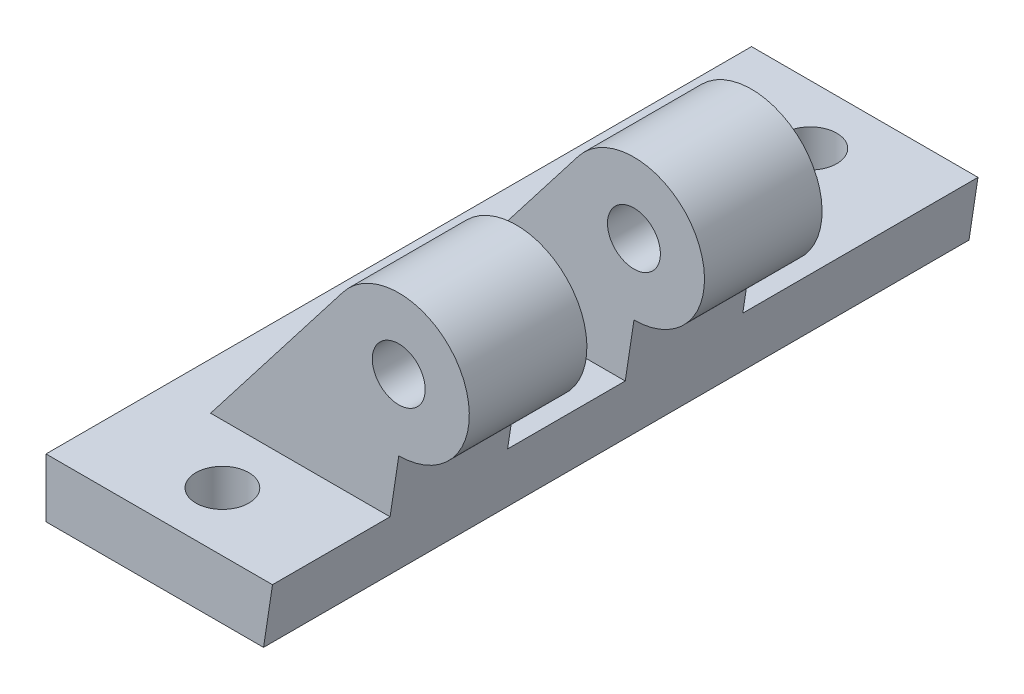
ISO-10303-21;
HEADER;
FILE_DESCRIPTION(('STEP AP214'),'2;1');
FILE_NAME('part.step','',(''),(''),'','','');
FILE_SCHEMA(('AUTOMOTIVE_DESIGN { 1 0 10303 214 1 1 1 1 }'));
ENDSEC;
DATA;
#1=APPLICATION_CONTEXT('core data for automotive mechanical design processes');
#2=APPLICATION_PROTOCOL_DEFINITION('international standard','automotive_design',2000,#1);
#3=PRODUCT_CONTEXT('',#1,'mechanical');
#4=PRODUCT('Part','Part','',(#3));
#5=PRODUCT_RELATED_PRODUCT_CATEGORY('part','',(#4));
#6=PRODUCT_DEFINITION_FORMATION('','',#4);
#7=PRODUCT_DEFINITION_CONTEXT('part definition',#1,'design');
#8=PRODUCT_DEFINITION('design','',#6,#7);
#9=PRODUCT_DEFINITION_SHAPE('','',#8);
#10=(LENGTH_UNIT() NAMED_UNIT(*) SI_UNIT(.MILLI.,.METRE.));
#11=(NAMED_UNIT(*) PLANE_ANGLE_UNIT() SI_UNIT($,.RADIAN.));
#12=(NAMED_UNIT(*) SI_UNIT($,.STERADIAN.) SOLID_ANGLE_UNIT());
#13=UNCERTAINTY_MEASURE_WITH_UNIT(LENGTH_MEASURE(1.E-05),#10,'distance_accuracy_value','');
#14=(GEOMETRIC_REPRESENTATION_CONTEXT(3) GLOBAL_UNCERTAINTY_ASSIGNED_CONTEXT((#13)) GLOBAL_UNIT_ASSIGNED_CONTEXT((#10,
#11,#12)) REPRESENTATION_CONTEXT('',''));
#15=CARTESIAN_POINT('',(0.,0.,0.));
#16=DIRECTION('',(0.,0.,1.));
#17=DIRECTION('',(1.,0.,0.));
#18=AXIS2_PLACEMENT_3D('',#15,#16,#17);
#19=CARTESIAN_POINT('',(0.,5.,0.));
#20=DIRECTION('',(0.,-1.,0.));
#21=DIRECTION('',(0.,0.,-1.));
#22=AXIS2_PLACEMENT_3D('',#19,#20,#21);
#23=PLANE('',#22);
#24=CARTESIAN_POINT('',(0.,5.,-25.));
#25=DIRECTION('',(0.,1.,0.));
#26=DIRECTION('',(0.,0.,1.));
#27=AXIS2_PLACEMENT_3D('',#24,#25,#26);
#28=CIRCLE('',#27,2.25);
#29=CARTESIAN_POINT('',(0.,5.,-22.75));
#30=VERTEX_POINT('',#29);
#31=EDGE_CURVE('E166',#30,#30,#28,.T.);
#32=ORIENTED_EDGE('',*,*,#31,.F.);
#33=EDGE_LOOP('',(#32));
#34=FACE_BOUND('',#33,.T.);
#35=CARTESIAN_POINT('',(0.,5.,25.));
#36=DIRECTION('',(0.,1.,0.));
#37=DIRECTION('',(0.,0.,1.));
#38=AXIS2_PLACEMENT_3D('',#35,#36,#37);
#39=CIRCLE('',#38,2.25);
#40=CARTESIAN_POINT('',(0.,5.,27.25));
#41=VERTEX_POINT('',#40);
#42=EDGE_CURVE('E174',#41,#41,#39,.T.);
#43=ORIENTED_EDGE('',*,*,#42,.F.);
#44=EDGE_LOOP('',(#43));
#45=FACE_BOUND('',#44,.T.);
#46=DIRECTION('',(1.,0.,0.));
#47=VECTOR('',#46,1.);
#48=CARTESIAN_POINT('',(-10.,5.,30.));
#49=LINE('',#48,#47);
#50=CARTESIAN_POINT('',(-10.,5.,30.));
#51=VERTEX_POINT('',#50);
#52=CARTESIAN_POINT('',(9.26024017208066,5.,30.));
#53=VERTEX_POINT('',#52);
#54=EDGE_CURVE('E158',#51,#53,#49,.T.);
#55=ORIENTED_EDGE('',*,*,#54,.T.);
#56=DIRECTION('',(0.,0.,-1.));
#57=VECTOR('',#56,1.);
#58=CARTESIAN_POINT('',(9.26024017208067,5.,0.));
#59=LINE('',#58,#57);
#60=CARTESIAN_POINT('',(9.26024017208066,5.,20.));
#61=VERTEX_POINT('',#60);
#62=EDGE_CURVE('E130',#53,#61,#59,.T.);
#63=ORIENTED_EDGE('',*,*,#62,.T.);
#64=DIRECTION('',(1.,0.,0.));
#65=VECTOR('',#64,1.);
#66=CARTESIAN_POINT('',(10.,5.,20.));
#67=LINE('',#66,#65);
#68=CARTESIAN_POINT('',(-5.99999999999998,5.,20.));
#69=VERTEX_POINT('',#68);
#70=EDGE_CURVE('E188',#69,#61,#67,.T.);
#71=ORIENTED_EDGE('',*,*,#70,.F.);
#72=DIRECTION('',(0.,0.,1.));
#73=VECTOR('',#72,1.);
#74=CARTESIAN_POINT('',(-5.99999999999998,5.,10.));
#75=LINE('',#74,#73);
#76=CARTESIAN_POINT('',(-5.99999999999998,5.,10.));
#77=VERTEX_POINT('',#76);
#78=EDGE_CURVE('E184',#77,#69,#75,.T.);
#79=ORIENTED_EDGE('',*,*,#78,.F.);
#80=DIRECTION('',(1.,0.,0.));
#81=VECTOR('',#80,1.);
#82=CARTESIAN_POINT('',(10.,5.,10.));
#83=LINE('',#82,#81);
#84=CARTESIAN_POINT('',(9.26024017208067,5.,10.));
#85=VERTEX_POINT('',#84);
#86=EDGE_CURVE('E185',#77,#85,#83,.T.);
#87=ORIENTED_EDGE('',*,*,#86,.T.);
#88=CARTESIAN_POINT('',(9.26024017208067,5.,0.));
#89=VERTEX_POINT('',#88);
#90=EDGE_CURVE('E244',#85,#89,#59,.T.);
#91=ORIENTED_EDGE('',*,*,#90,.T.);
#92=DIRECTION('',(-1.,0.,0.));
#93=VECTOR('',#92,1.);
#94=CARTESIAN_POINT('',(10.,5.,0.));
#95=LINE('',#94,#93);
#96=CARTESIAN_POINT('',(-5.99999999999998,5.,0.));
#97=VERTEX_POINT('',#96);
#98=EDGE_CURVE('E58',#89,#97,#95,.T.);
#99=ORIENTED_EDGE('',*,*,#98,.T.);
#100=DIRECTION('',(0.,0.,-1.));
#101=VECTOR('',#100,1.);
#102=CARTESIAN_POINT('',(-5.99999999999998,5.,0.));
#103=LINE('',#102,#101);
#104=CARTESIAN_POINT('',(-5.99999999999998,5.,-9.99999999999999));
#105=VERTEX_POINT('',#104);
#106=EDGE_CURVE('E215',#97,#105,#103,.T.);
#107=ORIENTED_EDGE('',*,*,#106,.T.);
#108=DIRECTION('',(-1.,0.,0.));
#109=VECTOR('',#108,1.);
#110=CARTESIAN_POINT('',(10.,5.,-9.99999999999999));
#111=LINE('',#110,#109);
#112=CARTESIAN_POINT('',(9.26024017208067,5.,-9.99999999999999));
#113=VERTEX_POINT('',#112);
#114=EDGE_CURVE('E223',#113,#105,#111,.T.);
#115=ORIENTED_EDGE('',*,*,#114,.F.);
#116=CARTESIAN_POINT('',(9.26024017208068,5.,-30.));
#117=VERTEX_POINT('',#116);
#118=EDGE_CURVE('E50',#113,#117,#59,.T.);
#119=ORIENTED_EDGE('',*,*,#118,.T.);
#120=DIRECTION('',(-1.,0.,0.));
#121=VECTOR('',#120,1.);
#122=CARTESIAN_POINT('',(-10.,5.,-30.));
#123=LINE('',#122,#121);
#124=CARTESIAN_POINT('',(-10.,5.,-30.));
#125=VERTEX_POINT('',#124);
#126=EDGE_CURVE('E150',#117,#125,#123,.T.);
#127=ORIENTED_EDGE('',*,*,#126,.T.);
#128=DIRECTION('',(0.,0.,1.));
#129=VECTOR('',#128,1.);
#130=CARTESIAN_POINT('',(-10.,5.,30.));
#131=LINE('',#130,#129);
#132=EDGE_CURVE('E153',#125,#51,#131,.T.);
#133=ORIENTED_EDGE('',*,*,#132,.T.);
#134=EDGE_LOOP('',(#55,#63,#71,#79,#87,#91,#99,#107,#115,#119,#127,#133));
#135=FACE_BOUND('',#134,.T.);
#136=ADVANCED_FACE('F36',(#34,#45,#135),#23,.F.);
#137=CARTESIAN_POINT('',(0.,0.,0.));
#138=DIRECTION('',(0.,-1.,0.));
#139=DIRECTION('',(0.,0.,-1.));
#140=AXIS2_PLACEMENT_3D('',#137,#138,#139);
#141=PLANE('',#140);
#142=DIRECTION('',(0.,0.,-1.));
#143=VECTOR('',#142,1.);
#144=CARTESIAN_POINT('',(8.49999999999998,0.,30.));
#145=LINE('',#144,#143);
#146=CARTESIAN_POINT('',(8.49999999999998,0.,30.));
#147=VERTEX_POINT('',#146);
#148=CARTESIAN_POINT('',(8.5,0.,-30.));
#149=VERTEX_POINT('',#148);
#150=EDGE_CURVE('E127',#147,#149,#145,.T.);
#151=ORIENTED_EDGE('',*,*,#150,.F.);
#152=DIRECTION('',(1.,0.,0.));
#153=VECTOR('',#152,1.);
#154=CARTESIAN_POINT('',(-10.,0.,30.));
#155=LINE('',#154,#153);
#156=CARTESIAN_POINT('',(-10.,0.,30.));
#157=VERTEX_POINT('',#156);
#158=EDGE_CURVE('E143',#157,#147,#155,.T.);
#159=ORIENTED_EDGE('',*,*,#158,.F.);
#160=DIRECTION('',(0.,0.,1.));
#161=VECTOR('',#160,1.);
#162=CARTESIAN_POINT('',(-10.,0.,30.));
#163=LINE('',#162,#161);
#164=CARTESIAN_POINT('',(-10.,0.,-30.));
#165=VERTEX_POINT('',#164);
#166=EDGE_CURVE('E151',#165,#157,#163,.T.);
#167=ORIENTED_EDGE('',*,*,#166,.F.);
#168=DIRECTION('',(-1.,0.,0.));
#169=VECTOR('',#168,1.);
#170=CARTESIAN_POINT('',(-10.,0.,-30.));
#171=LINE('',#170,#169);
#172=EDGE_CURVE('E144',#149,#165,#171,.T.);
#173=ORIENTED_EDGE('',*,*,#172,.F.);
#174=EDGE_LOOP('',(#151,#159,#167,#173));
#175=FACE_BOUND('',#174,.T.);
#176=CARTESIAN_POINT('',(0.,0.,-25.));
#177=DIRECTION('',(0.,1.,0.));
#178=DIRECTION('',(0.,0.,1.));
#179=AXIS2_PLACEMENT_3D('',#176,#177,#178);
#180=CIRCLE('',#179,2.25);
#181=CARTESIAN_POINT('',(0.,0.,-22.75));
#182=VERTEX_POINT('',#181);
#183=EDGE_CURVE('E168',#182,#182,#180,.T.);
#184=ORIENTED_EDGE('',*,*,#183,.T.);
#185=EDGE_LOOP('',(#184));
#186=FACE_BOUND('',#185,.T.);
#187=CARTESIAN_POINT('',(0.,0.,25.));
#188=DIRECTION('',(0.,1.,0.));
#189=DIRECTION('',(0.,0.,1.));
#190=AXIS2_PLACEMENT_3D('',#187,#188,#189);
#191=CIRCLE('',#190,2.25);
#192=CARTESIAN_POINT('',(0.,0.,27.25));
#193=VERTEX_POINT('',#192);
#194=EDGE_CURVE('E176',#193,#193,#191,.T.);
#195=ORIENTED_EDGE('',*,*,#194,.T.);
#196=EDGE_LOOP('',(#195));
#197=FACE_BOUND('',#196,.T.);
#198=ADVANCED_FACE('F140',(#175,#186,#197),#141,.T.);
#199=CARTESIAN_POINT('',(-10.,5.,-30.));
#200=DIRECTION('',(0.,0.,1.));
#201=DIRECTION('',(1.,0.,0.));
#202=AXIS2_PLACEMENT_3D('',#199,#200,#201);
#203=PLANE('',#202);
#204=ORIENTED_EDGE('',*,*,#126,.F.);
#205=DIRECTION('',(0.150320364149724,0.988637339028774,0.));
#206=VECTOR('',#205,1.);
#207=CARTESIAN_POINT('',(8.5,0.,-30.));
#208=LINE('',#207,#206);
#209=EDGE_CURVE('E135',#149,#117,#208,.T.);
#210=ORIENTED_EDGE('',*,*,#209,.F.);
#211=ORIENTED_EDGE('',*,*,#172,.T.);
#212=DIRECTION('',(0.,-1.,0.));
#213=VECTOR('',#212,1.);
#214=CARTESIAN_POINT('',(-10.,5.,-30.));
#215=LINE('',#214,#213);
#216=EDGE_CURVE('E44',#125,#165,#215,.T.);
#217=ORIENTED_EDGE('',*,*,#216,.F.);
#218=EDGE_LOOP('',(#204,#210,#211,#217));
#219=FACE_BOUND('',#218,.T.);
#220=ADVANCED_FACE('F38',(#219),#203,.F.);
#221=CARTESIAN_POINT('',(-10.,5.,30.));
#222=DIRECTION('',(1.,0.,0.));
#223=DIRECTION('',(0.,0.,-1.));
#224=AXIS2_PLACEMENT_3D('',#221,#222,#223);
#225=PLANE('',#224);
#226=ORIENTED_EDGE('',*,*,#166,.T.);
#227=DIRECTION('',(0.,-1.,0.));
#228=VECTOR('',#227,1.);
#229=CARTESIAN_POINT('',(-10.,5.,30.));
#230=LINE('',#229,#228);
#231=EDGE_CURVE('E149',#51,#157,#230,.T.);
#232=ORIENTED_EDGE('',*,*,#231,.F.);
#233=ORIENTED_EDGE('',*,*,#132,.F.);
#234=ORIENTED_EDGE('',*,*,#216,.T.);
#235=EDGE_LOOP('',(#226,#232,#233,#234));
#236=FACE_BOUND('',#235,.T.);
#237=ADVANCED_FACE('F163',(#236),#225,.F.);
#238=CARTESIAN_POINT('',(-10.,5.,30.));
#239=DIRECTION('',(0.,0.,-1.));
#240=DIRECTION('',(-1.,0.,0.));
#241=AXIS2_PLACEMENT_3D('',#238,#239,#240);
#242=PLANE('',#241);
#243=ORIENTED_EDGE('',*,*,#158,.T.);
#244=DIRECTION('',(0.150320364149724,0.988637339028774,0.));
#245=VECTOR('',#244,1.);
#246=CARTESIAN_POINT('',(8.49999999999998,0.,30.));
#247=LINE('',#246,#245);
#248=EDGE_CURVE('E124',#147,#53,#247,.T.);
#249=ORIENTED_EDGE('',*,*,#248,.T.);
#250=ORIENTED_EDGE('',*,*,#54,.F.);
#251=ORIENTED_EDGE('',*,*,#231,.T.);
#252=EDGE_LOOP('',(#243,#249,#250,#251));
#253=FACE_BOUND('',#252,.T.);
#254=ADVANCED_FACE('F147',(#253),#242,.F.);
#255=CARTESIAN_POINT('',(0.,5.,-25.));
#256=DIRECTION('',(0.,-1.,0.));
#257=DIRECTION('',(0.,0.,-1.));
#258=AXIS2_PLACEMENT_3D('',#255,#256,#257);
#259=CYLINDRICAL_SURFACE('',#258,2.25);
#260=ORIENTED_EDGE('',*,*,#31,.T.);
#261=EDGE_LOOP('',(#260));
#262=FACE_BOUND('',#261,.T.);
#263=ORIENTED_EDGE('',*,*,#183,.F.);
#264=EDGE_LOOP('',(#263));
#265=FACE_BOUND('',#264,.T.);
#266=ADVANCED_FACE('F284',(#262,#265),#259,.F.);
#267=CARTESIAN_POINT('',(0.,5.,25.));
#268=DIRECTION('',(0.,-1.,0.));
#269=DIRECTION('',(0.,0.,-1.));
#270=AXIS2_PLACEMENT_3D('',#267,#268,#269);
#271=CYLINDRICAL_SURFACE('',#270,2.25);
#272=ORIENTED_EDGE('',*,*,#42,.T.);
#273=EDGE_LOOP('',(#272));
#274=FACE_BOUND('',#273,.T.);
#275=ORIENTED_EDGE('',*,*,#194,.F.);
#276=EDGE_LOOP('',(#275));
#277=FACE_BOUND('',#276,.T.);
#278=ADVANCED_FACE('F356',(#274,#277),#271,.F.);
#279=CARTESIAN_POINT('',(10.,15.8653034599232,10.));
#280=DIRECTION('',(0.,0.,1.));
#281=DIRECTION('',(1.,0.,0.));
#282=AXIS2_PLACEMENT_3D('',#279,#280,#281);
#283=CYLINDRICAL_SURFACE('',#282,6.);
#284=CARTESIAN_POINT('',(10.,15.8653034599232,20.));
#285=DIRECTION('',(0.,0.,1.));
#286=DIRECTION('',(1.,0.,0.));
#287=AXIS2_PLACEMENT_3D('',#284,#285,#286);
#288=CIRCLE('',#287,6.);
#289=CARTESIAN_POINT('',(10.,9.86530345992323,20.));
#290=VERTEX_POINT('',#289);
#291=CARTESIAN_POINT('',(5.25568408624558,19.5383766296949,20.));
#292=VERTEX_POINT('',#291);
#293=EDGE_CURVE('E195',#290,#292,#288,.T.);
#294=ORIENTED_EDGE('',*,*,#293,.F.);
#295=DIRECTION('',(0.,0.,1.));
#296=VECTOR('',#295,1.);
#297=CARTESIAN_POINT('',(10.,9.86530345992323,10.));
#298=LINE('',#297,#296);
#299=CARTESIAN_POINT('',(10.,9.86530345992323,10.));
#300=VERTEX_POINT('',#299);
#301=EDGE_CURVE('E179',#300,#290,#298,.T.);
#302=ORIENTED_EDGE('',*,*,#301,.F.);
#303=CARTESIAN_POINT('',(10.,15.8653034599232,10.));
#304=DIRECTION('',(0.,0.,1.));
#305=DIRECTION('',(1.,0.,0.));
#306=AXIS2_PLACEMENT_3D('',#303,#304,#305);
#307=CIRCLE('',#306,6.);
#308=CARTESIAN_POINT('',(5.25568408624558,19.5383766296949,10.));
#309=VERTEX_POINT('',#308);
#310=EDGE_CURVE('E191',#300,#309,#307,.T.);
#311=ORIENTED_EDGE('',*,*,#310,.T.);
#312=DIRECTION('',(0.,0.,1.));
#313=VECTOR('',#312,1.);
#314=CARTESIAN_POINT('',(5.25568408624558,19.5383766296949,10.));
#315=LINE('',#314,#313);
#316=EDGE_CURVE('E182',#309,#292,#315,.T.);
#317=ORIENTED_EDGE('',*,*,#316,.T.);
#318=EDGE_LOOP('',(#294,#302,#311,#317));
#319=FACE_BOUND('',#318,.T.);
#320=ADVANCED_FACE('F346',(#319),#283,.T.);
#321=CARTESIAN_POINT('',(-5.99999999999998,5.,10.));
#322=DIRECTION('',(-0.790719318959074,0.612178861628608,0.));
#323=DIRECTION('',(-0.612178861628608,-0.790719318959074,0.));
#324=AXIS2_PLACEMENT_3D('',#321,#322,#323);
#325=PLANE('',#324);
#326=DIRECTION('',(-0.612178861628608,-0.790719318959074,0.));
#327=VECTOR('',#326,1.);
#328=CARTESIAN_POINT('',(-5.99999999999998,5.,20.));
#329=LINE('',#328,#327);
#330=EDGE_CURVE('E192',#292,#69,#329,.T.);
#331=ORIENTED_EDGE('',*,*,#330,.F.);
#332=ORIENTED_EDGE('',*,*,#316,.F.);
#333=DIRECTION('',(-0.612178861628608,-0.790719318959074,0.));
#334=VECTOR('',#333,1.);
#335=CARTESIAN_POINT('',(-5.99999999999998,5.,10.));
#336=LINE('',#335,#334);
#337=EDGE_CURVE('E201',#309,#77,#336,.T.);
#338=ORIENTED_EDGE('',*,*,#337,.T.);
#339=ORIENTED_EDGE('',*,*,#78,.T.);
#340=EDGE_LOOP('',(#331,#332,#338,#339));
#341=FACE_BOUND('',#340,.T.);
#342=ADVANCED_FACE('F340',(#341),#325,.T.);
#343=CARTESIAN_POINT('',(10.,15.8653034599232,10.));
#344=DIRECTION('',(0.,0.,1.));
#345=DIRECTION('',(1.,0.,0.));
#346=AXIS2_PLACEMENT_3D('',#343,#344,#345);
#347=PLANE('',#346);
#348=CARTESIAN_POINT('',(10.,15.8653034599232,10.));
#349=DIRECTION('',(0.,0.,1.));
#350=DIRECTION('',(1.,0.,0.));
#351=AXIS2_PLACEMENT_3D('',#348,#349,#350);
#352=CIRCLE('',#351,2.25);
#353=CARTESIAN_POINT('',(12.25,15.8653034599232,10.));
#354=VERTEX_POINT('',#353);
#355=EDGE_CURVE('E198',#354,#354,#352,.T.);
#356=ORIENTED_EDGE('',*,*,#355,.T.);
#357=EDGE_LOOP('',(#356));
#358=FACE_BOUND('',#357,.T.);
#359=ORIENTED_EDGE('',*,*,#310,.F.);
#360=DIRECTION('',(-0.150320364149724,-0.988637339028774,0.));
#361=VECTOR('',#360,1.);
#362=CARTESIAN_POINT('',(10.8916739488889,15.7297261886546,10.));
#363=LINE('',#362,#361);
#364=EDGE_CURVE('E241',#300,#85,#363,.T.);
#365=ORIENTED_EDGE('',*,*,#364,.T.);
#366=ORIENTED_EDGE('',*,*,#86,.F.);
#367=ORIENTED_EDGE('',*,*,#337,.F.);
#368=EDGE_LOOP('',(#359,#365,#366,#367));
#369=FACE_BOUND('',#368,.T.);
#370=ADVANCED_FACE('F345',(#358,#369),#347,.F.);
#371=CARTESIAN_POINT('',(10.,15.8653034599232,20.));
#372=DIRECTION('',(0.,0.,1.));
#373=DIRECTION('',(1.,0.,0.));
#374=AXIS2_PLACEMENT_3D('',#371,#372,#373);
#375=PLANE('',#374);
#376=DIRECTION('',(-0.150320364149724,-0.988637339028774,0.));
#377=VECTOR('',#376,1.);
#378=CARTESIAN_POINT('',(10.8916739488889,15.7297261886546,20.));
#379=LINE('',#378,#377);
#380=EDGE_CURVE('E239',#290,#61,#379,.T.);
#381=ORIENTED_EDGE('',*,*,#380,.F.);
#382=ORIENTED_EDGE('',*,*,#293,.T.);
#383=ORIENTED_EDGE('',*,*,#330,.T.);
#384=ORIENTED_EDGE('',*,*,#70,.T.);
#385=EDGE_LOOP('',(#381,#382,#383,#384));
#386=FACE_BOUND('',#385,.T.);
#387=CARTESIAN_POINT('',(10.,15.8653034599232,20.));
#388=DIRECTION('',(0.,0.,1.));
#389=DIRECTION('',(1.,0.,0.));
#390=AXIS2_PLACEMENT_3D('',#387,#388,#389);
#391=CIRCLE('',#390,2.25);
#392=CARTESIAN_POINT('',(12.25,15.8653034599232,20.));
#393=VERTEX_POINT('',#392);
#394=EDGE_CURVE('E206',#393,#393,#391,.T.);
#395=ORIENTED_EDGE('',*,*,#394,.F.);
#396=EDGE_LOOP('',(#395));
#397=FACE_BOUND('',#396,.T.);
#398=ADVANCED_FACE('F332',(#386,#397),#375,.T.);
#399=CARTESIAN_POINT('',(10.,15.8653034599232,10.));
#400=DIRECTION('',(0.,0.,1.));
#401=DIRECTION('',(1.,0.,0.));
#402=AXIS2_PLACEMENT_3D('',#399,#400,#401);
#403=CYLINDRICAL_SURFACE('',#402,2.25);
#404=ORIENTED_EDGE('',*,*,#355,.F.);
#405=EDGE_LOOP('',(#404));
#406=FACE_BOUND('',#405,.T.);
#407=ORIENTED_EDGE('',*,*,#394,.T.);
#408=EDGE_LOOP('',(#407));
#409=FACE_BOUND('',#408,.T.);
#410=ADVANCED_FACE('F271',(#406,#409),#403,.F.);
#411=CARTESIAN_POINT('',(10.,15.8653034599232,0.));
#412=DIRECTION('',(0.,0.,-1.));
#413=DIRECTION('',(-1.,0.,0.));
#414=AXIS2_PLACEMENT_3D('',#411,#412,#413);
#415=CYLINDRICAL_SURFACE('',#414,6.00000000000001);
#416=CARTESIAN_POINT('',(10.,15.8653034599232,-9.99999999999999));
#417=DIRECTION('',(0.,0.,-1.));
#418=DIRECTION('',(-1.,0.,0.));
#419=AXIS2_PLACEMENT_3D('',#416,#417,#418);
#420=CIRCLE('',#419,6.00000000000001);
#421=CARTESIAN_POINT('',(5.29341514188912,19.5866014825762,-9.99999999999999));
#422=VERTEX_POINT('',#421);
#423=CARTESIAN_POINT('',(10.,9.86530345992323,-9.99999999999998));
#424=VERTEX_POINT('',#423);
#425=EDGE_CURVE('E225',#422,#424,#420,.T.);
#426=ORIENTED_EDGE('',*,*,#425,.F.);
#427=DIRECTION('',(0.,0.,-1.));
#428=VECTOR('',#427,1.);
#429=CARTESIAN_POINT('',(5.29341514188912,19.5866014825762,0.));
#430=LINE('',#429,#428);
#431=CARTESIAN_POINT('',(5.29341514188912,19.5866014825762,0.));
#432=VERTEX_POINT('',#431);
#433=EDGE_CURVE('E209',#432,#422,#430,.T.);
#434=ORIENTED_EDGE('',*,*,#433,.F.);
#435=CARTESIAN_POINT('',(10.,15.8653034599232,0.));
#436=DIRECTION('',(0.,0.,-1.));
#437=DIRECTION('',(-1.,0.,0.));
#438=AXIS2_PLACEMENT_3D('',#435,#436,#437);
#439=CIRCLE('',#438,6.00000000000001);
#440=CARTESIAN_POINT('',(10.,9.86530345992323,0.));
#441=VERTEX_POINT('',#440);
#442=EDGE_CURVE('E222',#432,#441,#439,.T.);
#443=ORIENTED_EDGE('',*,*,#442,.T.);
#444=DIRECTION('',(0.,0.,-1.));
#445=VECTOR('',#444,1.);
#446=CARTESIAN_POINT('',(10.,9.86530345992323,0.));
#447=LINE('',#446,#445);
#448=EDGE_CURVE('E212',#441,#424,#447,.T.);
#449=ORIENTED_EDGE('',*,*,#448,.T.);
#450=EDGE_LOOP('',(#426,#434,#443,#449));
#451=FACE_BOUND('',#450,.T.);
#452=ADVANCED_FACE('F256',(#451),#415,.T.);
#453=CARTESIAN_POINT('',(-5.99999999999998,5.,0.));
#454=DIRECTION('',(-0.790708950577508,0.612192253688836,0.));
#455=DIRECTION('',(-0.612192253688836,-0.790708950577508,0.));
#456=AXIS2_PLACEMENT_3D('',#453,#454,#455);
#457=PLANE('',#456);
#458=DIRECTION('',(0.612192253688836,0.790708950577508,0.));
#459=VECTOR('',#458,1.);
#460=CARTESIAN_POINT('',(-5.99999999999998,5.,-9.99999999999999));
#461=LINE('',#460,#459);
#462=EDGE_CURVE('E219',#105,#422,#461,.T.);
#463=ORIENTED_EDGE('',*,*,#462,.F.);
#464=ORIENTED_EDGE('',*,*,#106,.F.);
#465=DIRECTION('',(0.612192253688836,0.790708950577508,0.));
#466=VECTOR('',#465,1.);
#467=CARTESIAN_POINT('',(-5.99999999999998,5.,0.));
#468=LINE('',#467,#466);
#469=EDGE_CURVE('E216',#97,#432,#468,.T.);
#470=ORIENTED_EDGE('',*,*,#469,.T.);
#471=ORIENTED_EDGE('',*,*,#433,.T.);
#472=EDGE_LOOP('',(#463,#464,#470,#471));
#473=FACE_BOUND('',#472,.T.);
#474=ADVANCED_FACE('F262',(#473),#457,.T.);
#475=CARTESIAN_POINT('',(10.,15.8653034599232,0.));
#476=DIRECTION('',(0.,0.,-1.));
#477=DIRECTION('',(-1.,0.,0.));
#478=AXIS2_PLACEMENT_3D('',#475,#476,#477);
#479=PLANE('',#478);
#480=CARTESIAN_POINT('',(10.,15.8653034599232,0.));
#481=DIRECTION('',(0.,0.,-1.));
#482=DIRECTION('',(-1.,0.,0.));
#483=AXIS2_PLACEMENT_3D('',#480,#481,#482);
#484=CIRCLE('',#483,2.25);
#485=CARTESIAN_POINT('',(7.75000000000002,15.8653034599232,0.));
#486=VERTEX_POINT('',#485);
#487=EDGE_CURVE('E228',#486,#486,#484,.T.);
#488=ORIENTED_EDGE('',*,*,#487,.T.);
#489=EDGE_LOOP('',(#488));
#490=FACE_BOUND('',#489,.T.);
#491=ORIENTED_EDGE('',*,*,#98,.F.);
#492=DIRECTION('',(0.150320364149724,0.988637339028774,0.));
#493=VECTOR('',#492,1.);
#494=CARTESIAN_POINT('',(10.8916739488889,15.7297261886546,0.));
#495=LINE('',#494,#493);
#496=EDGE_CURVE('E245',#89,#441,#495,.T.);
#497=ORIENTED_EDGE('',*,*,#496,.T.);
#498=ORIENTED_EDGE('',*,*,#442,.F.);
#499=ORIENTED_EDGE('',*,*,#469,.F.);
#500=EDGE_LOOP('',(#491,#497,#498,#499));
#501=FACE_BOUND('',#500,.T.);
#502=ADVANCED_FACE('F260',(#490,#501),#479,.F.);
#503=CARTESIAN_POINT('',(10.,15.8653034599232,-9.99999999999999));
#504=DIRECTION('',(0.,0.,-1.));
#505=DIRECTION('',(-1.,0.,0.));
#506=AXIS2_PLACEMENT_3D('',#503,#504,#505);
#507=PLANE('',#506);
#508=DIRECTION('',(0.150320364149724,0.988637339028774,0.));
#509=VECTOR('',#508,1.);
#510=CARTESIAN_POINT('',(10.8916739488889,15.7297261886546,-9.99999999999999));
#511=LINE('',#510,#509);
#512=EDGE_CURVE('E11',#113,#424,#511,.T.);
#513=ORIENTED_EDGE('',*,*,#512,.F.);
#514=ORIENTED_EDGE('',*,*,#114,.T.);
#515=ORIENTED_EDGE('',*,*,#462,.T.);
#516=ORIENTED_EDGE('',*,*,#425,.T.);
#517=EDGE_LOOP('',(#513,#514,#515,#516));
#518=FACE_BOUND('',#517,.T.);
#519=CARTESIAN_POINT('',(10.,15.8653034599232,-9.99999999999999));
#520=DIRECTION('',(0.,0.,-1.));
#521=DIRECTION('',(-1.,0.,0.));
#522=AXIS2_PLACEMENT_3D('',#519,#520,#521);
#523=CIRCLE('',#522,2.25);
#524=CARTESIAN_POINT('',(7.75000000000002,15.8653034599232,-9.99999999999999));
#525=VERTEX_POINT('',#524);
#526=EDGE_CURVE('E234',#525,#525,#523,.T.);
#527=ORIENTED_EDGE('',*,*,#526,.F.);
#528=EDGE_LOOP('',(#527));
#529=FACE_BOUND('',#528,.T.);
#530=ADVANCED_FACE('F252',(#518,#529),#507,.T.);
#531=CARTESIAN_POINT('',(10.,15.8653034599232,0.));
#532=DIRECTION('',(0.,0.,-1.));
#533=DIRECTION('',(-1.,0.,0.));
#534=AXIS2_PLACEMENT_3D('',#531,#532,#533);
#535=CYLINDRICAL_SURFACE('',#534,2.25);
#536=ORIENTED_EDGE('',*,*,#487,.F.);
#537=EDGE_LOOP('',(#536));
#538=FACE_BOUND('',#537,.T.);
#539=ORIENTED_EDGE('',*,*,#526,.T.);
#540=EDGE_LOOP('',(#539));
#541=FACE_BOUND('',#540,.T.);
#542=ADVANCED_FACE('F310',(#538,#541),#535,.F.);
#543=CARTESIAN_POINT('',(8.49999999999998,0.,30.));
#544=DIRECTION('',(-0.988637339028774,0.150320364149724,0.));
#545=DIRECTION('',(-0.150320364149724,-0.988637339028774,0.));
#546=AXIS2_PLACEMENT_3D('',#543,#544,#545);
#547=PLANE('',#546);
#548=ORIENTED_EDGE('',*,*,#248,.F.);
#549=ORIENTED_EDGE('',*,*,#150,.T.);
#550=ORIENTED_EDGE('',*,*,#209,.T.);
#551=ORIENTED_EDGE('',*,*,#118,.F.);
#552=ORIENTED_EDGE('',*,*,#512,.T.);
#553=ORIENTED_EDGE('',*,*,#448,.F.);
#554=ORIENTED_EDGE('',*,*,#496,.F.);
#555=ORIENTED_EDGE('',*,*,#90,.F.);
#556=ORIENTED_EDGE('',*,*,#364,.F.);
#557=ORIENTED_EDGE('',*,*,#301,.T.);
#558=ORIENTED_EDGE('',*,*,#380,.T.);
#559=ORIENTED_EDGE('',*,*,#62,.F.);
#560=EDGE_LOOP('',(#548,#549,#550,#551,#552,#553,#554,#555,#556,#557,#558,#559));
#561=FACE_BOUND('',#560,.T.);
#562=ADVANCED_FACE('F126',(#561),#547,.F.);
#563=CLOSED_SHELL('',(#136,#198,#220,#237,#254,#266,#278,#320,#342,#370,#398,#410,#452,#474,
#502,#530,#542,#562));
#564=MANIFOLD_SOLID_BREP('B2',#563);
#565=ADVANCED_BREP_SHAPE_REPRESENTATION('',(#18,#564),#14);
#566=SHAPE_DEFINITION_REPRESENTATION(#9,#565);
ENDSEC;
END-ISO-10303-21;
